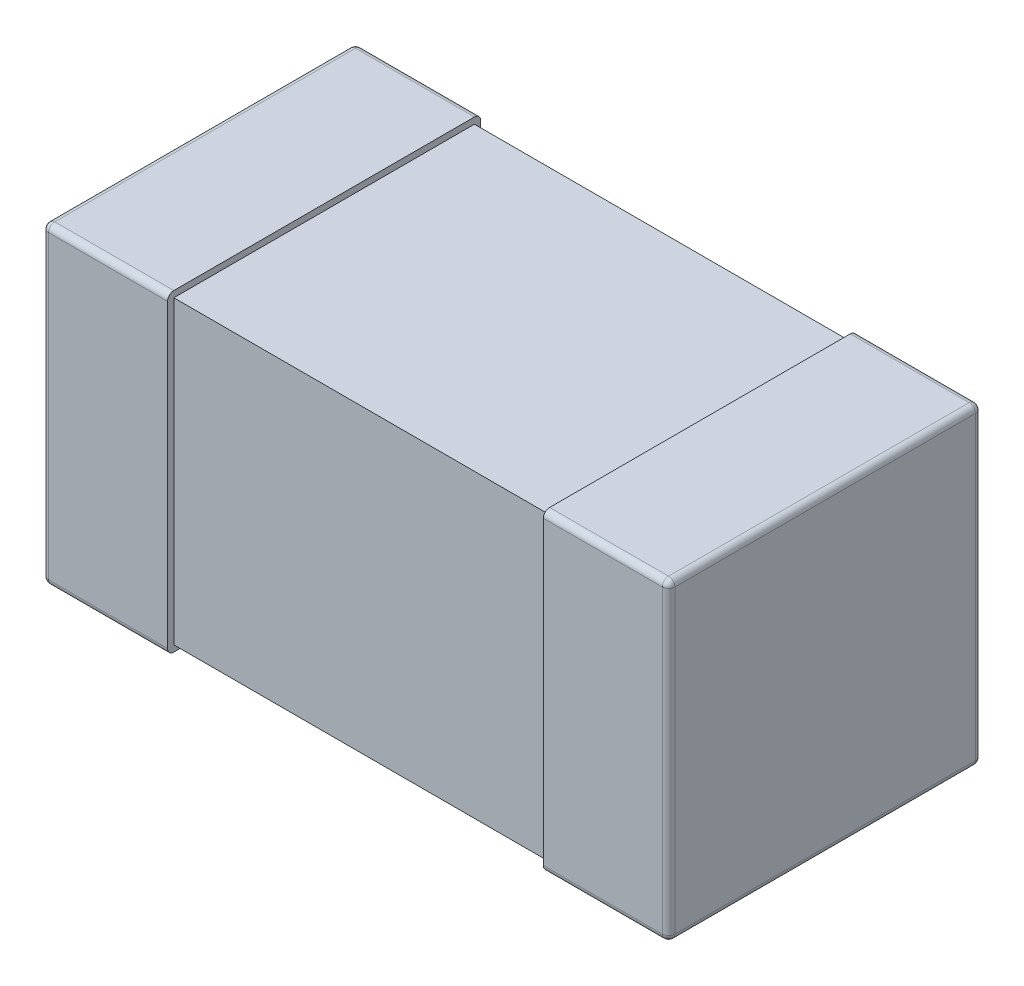
ISO-10303-21;
HEADER;
FILE_DESCRIPTION(('STEP AP214'),'2;1');
FILE_NAME('part.step','',(''),(''),'','','');
FILE_SCHEMA(('AUTOMOTIVE_DESIGN { 1 0 10303 214 1 1 1 1 }'));
ENDSEC;
DATA;
#1=APPLICATION_CONTEXT('core data for automotive mechanical design processes');
#2=APPLICATION_PROTOCOL_DEFINITION('international standard','automotive_design',2000,#1);
#3=PRODUCT_CONTEXT('',#1,'mechanical');
#4=PRODUCT('Part','Part','',(#3));
#5=PRODUCT_RELATED_PRODUCT_CATEGORY('part','',(#4));
#6=PRODUCT_DEFINITION_FORMATION('','',#4);
#7=PRODUCT_DEFINITION_CONTEXT('part definition',#1,'design');
#8=PRODUCT_DEFINITION('design','',#6,#7);
#9=PRODUCT_DEFINITION_SHAPE('','',#8);
#10=(LENGTH_UNIT() NAMED_UNIT(*) SI_UNIT(.MILLI.,.METRE.));
#11=(NAMED_UNIT(*) PLANE_ANGLE_UNIT() SI_UNIT($,.RADIAN.));
#12=(NAMED_UNIT(*) SI_UNIT($,.STERADIAN.) SOLID_ANGLE_UNIT());
#13=UNCERTAINTY_MEASURE_WITH_UNIT(LENGTH_MEASURE(1.E-05),#10,'distance_accuracy_value','');
#14=(GEOMETRIC_REPRESENTATION_CONTEXT(3) GLOBAL_UNCERTAINTY_ASSIGNED_CONTEXT((#13)) GLOBAL_UNIT_ASSIGNED_CONTEXT((#10,
#11,#12)) REPRESENTATION_CONTEXT('',''));
#15=CARTESIAN_POINT('',(0.,0.,0.));
#16=DIRECTION('',(0.,0.,1.));
#17=DIRECTION('',(1.,0.,0.));
#18=AXIS2_PLACEMENT_3D('',#15,#16,#17);
#19=CARTESIAN_POINT('',(-0.5,0.25,-0.25));
#20=DIRECTION('',(1.,0.,0.));
#21=DIRECTION('',(0.,0.,-1.));
#22=AXIS2_PLACEMENT_3D('',#19,#20,#21);
#23=PLANE('',#22);
#24=DIRECTION('',(0.,-1.,0.));
#25=VECTOR('',#24,1.);
#26=CARTESIAN_POINT('',(-0.5,0.25,-0.24));
#27=LINE('',#26,#25);
#28=CARTESIAN_POINT('',(-0.5,0.24,-0.24));
#29=VERTEX_POINT('',#28);
#30=CARTESIAN_POINT('',(-0.5,-0.24,-0.24));
#31=VERTEX_POINT('',#30);
#32=EDGE_CURVE('E351',#29,#31,#27,.T.);
#33=ORIENTED_EDGE('',*,*,#32,.T.);
#34=DIRECTION('',(0.,0.,1.));
#35=VECTOR('',#34,1.);
#36=CARTESIAN_POINT('',(-0.5,-0.24,-0.25));
#37=LINE('',#36,#35);
#38=CARTESIAN_POINT('',(-0.5,-0.24,0.24));
#39=VERTEX_POINT('',#38);
#40=EDGE_CURVE('E353',#31,#39,#37,.T.);
#41=ORIENTED_EDGE('',*,*,#40,.T.);
#42=DIRECTION('',(0.,-1.,0.));
#43=VECTOR('',#42,1.);
#44=CARTESIAN_POINT('',(-0.5,0.25,0.24));
#45=LINE('',#44,#43);
#46=CARTESIAN_POINT('',(-0.5,0.24,0.24));
#47=VERTEX_POINT('',#46);
#48=EDGE_CURVE('E349',#39,#47,#45,.F.);
#49=ORIENTED_EDGE('',*,*,#48,.T.);
#50=DIRECTION('',(0.,0.,1.));
#51=VECTOR('',#50,1.);
#52=CARTESIAN_POINT('',(-0.5,0.24,-0.25));
#53=LINE('',#52,#51);
#54=EDGE_CURVE('E347',#47,#29,#53,.F.);
#55=ORIENTED_EDGE('',*,*,#54,.T.);
#56=EDGE_LOOP('',(#33,#41,#49,#55));
#57=FACE_BOUND('',#56,.T.);
#58=ADVANCED_FACE('F36',(#57),#23,.F.);
#59=CARTESIAN_POINT('',(-0.5,0.25,0.25));
#60=DIRECTION('',(0.,0.,-1.));
#61=DIRECTION('',(-1.,0.,0.));
#62=AXIS2_PLACEMENT_3D('',#59,#60,#61);
#63=PLANE('',#62);
#64=DIRECTION('',(0.,-1.,0.));
#65=VECTOR('',#64,1.);
#66=CARTESIAN_POINT('',(-0.49,0.25,0.25));
#67=LINE('',#66,#65);
#68=CARTESIAN_POINT('',(-0.49,0.24,0.25));
#69=VERTEX_POINT('',#68);
#70=CARTESIAN_POINT('',(-0.49,-0.24,0.25));
#71=VERTEX_POINT('',#70);
#72=EDGE_CURVE('E379',#69,#71,#67,.T.);
#73=ORIENTED_EDGE('',*,*,#72,.T.);
#74=DIRECTION('',(1.,0.,0.));
#75=VECTOR('',#74,1.);
#76=CARTESIAN_POINT('',(-0.5,-0.24,0.25));
#77=LINE('',#76,#75);
#78=CARTESIAN_POINT('',(-0.3,-0.24,0.25));
#79=VERTEX_POINT('',#78);
#80=EDGE_CURVE('E381',#71,#79,#77,.T.);
#81=ORIENTED_EDGE('',*,*,#80,.T.);
#82=DIRECTION('',(0.,-1.,0.));
#83=VECTOR('',#82,1.);
#84=CARTESIAN_POINT('',(-0.3,0.25,0.25));
#85=LINE('',#84,#83);
#86=CARTESIAN_POINT('',(-0.3,0.24,0.25));
#87=VERTEX_POINT('',#86);
#88=EDGE_CURVE('E344',#87,#79,#85,.T.);
#89=ORIENTED_EDGE('',*,*,#88,.F.);
#90=DIRECTION('',(1.,0.,0.));
#91=VECTOR('',#90,1.);
#92=CARTESIAN_POINT('',(-0.5,0.24,0.25));
#93=LINE('',#92,#91);
#94=EDGE_CURVE('E377',#87,#69,#93,.F.);
#95=ORIENTED_EDGE('',*,*,#94,.T.);
#96=EDGE_LOOP('',(#73,#81,#89,#95));
#97=FACE_BOUND('',#96,.T.);
#98=ADVANCED_FACE('F450',(#97),#63,.F.);
#99=CARTESIAN_POINT('',(-0.3,0.25,-0.25));
#100=DIRECTION('',(-1.,0.,0.));
#101=DIRECTION('',(0.,0.,1.));
#102=AXIS2_PLACEMENT_3D('',#99,#100,#101);
#103=PLANE('',#102);
#104=DIRECTION('',(0.,1.,0.));
#105=VECTOR('',#104,1.);
#106=CARTESIAN_POINT('',(-0.3,0.24,-0.24));
#107=LINE('',#106,#105);
#108=CARTESIAN_POINT('',(-0.3,-0.24,-0.24));
#109=VERTEX_POINT('',#108);
#110=CARTESIAN_POINT('',(-0.3,0.24,-0.24));
#111=VERTEX_POINT('',#110);
#112=EDGE_CURVE('E210',#109,#111,#107,.T.);
#113=ORIENTED_EDGE('',*,*,#112,.F.);
#114=DIRECTION('',(0.,0.,-1.));
#115=VECTOR('',#114,1.);
#116=CARTESIAN_POINT('',(-0.3,-0.24,0.24));
#117=LINE('',#116,#115);
#118=CARTESIAN_POINT('',(-0.3,-0.24,0.24));
#119=VERTEX_POINT('',#118);
#120=EDGE_CURVE('E205',#119,#109,#117,.T.);
#121=ORIENTED_EDGE('',*,*,#120,.F.);
#122=DIRECTION('',(0.,-1.,0.));
#123=VECTOR('',#122,1.);
#124=CARTESIAN_POINT('',(-0.3,0.24,0.24));
#125=LINE('',#124,#123);
#126=CARTESIAN_POINT('',(-0.3,0.24,0.24));
#127=VERTEX_POINT('',#126);
#128=EDGE_CURVE('E326',#127,#119,#125,.T.);
#129=ORIENTED_EDGE('',*,*,#128,.F.);
#130=DIRECTION('',(0.,0.,1.));
#131=VECTOR('',#130,1.);
#132=CARTESIAN_POINT('',(-0.3,0.24,0.24));
#133=LINE('',#132,#131);
#134=EDGE_CURVE('E53',#111,#127,#133,.T.);
#135=ORIENTED_EDGE('',*,*,#134,.F.);
#136=EDGE_LOOP('',(#113,#121,#129,#135));
#137=FACE_BOUND('',#136,.T.);
#138=DIRECTION('',(0.,0.,-1.));
#139=VECTOR('',#138,1.);
#140=CARTESIAN_POINT('',(-0.3,-0.25,-0.25));
#141=LINE('',#140,#139);
#142=CARTESIAN_POINT('',(-0.3,-0.25,0.24));
#143=VERTEX_POINT('',#142);
#144=CARTESIAN_POINT('',(-0.3,-0.25,-0.24));
#145=VERTEX_POINT('',#144);
#146=EDGE_CURVE('E339',#143,#145,#141,.T.);
#147=ORIENTED_EDGE('',*,*,#146,.T.);
#148=CARTESIAN_POINT('',(-0.3,-0.24,-0.24));
#149=DIRECTION('',(-1.,0.,0.));
#150=DIRECTION('',(0.,0.,1.));
#151=AXIS2_PLACEMENT_3D('',#148,#149,#150);
#152=CIRCLE('',#151,0.01);
#153=CARTESIAN_POINT('',(-0.3,-0.24,-0.25));
#154=VERTEX_POINT('',#153);
#155=EDGE_CURVE('E375',#145,#154,#152,.F.);
#156=ORIENTED_EDGE('',*,*,#155,.T.);
#157=DIRECTION('',(0.,-1.,0.));
#158=VECTOR('',#157,1.);
#159=CARTESIAN_POINT('',(-0.3,0.25,-0.25));
#160=LINE('',#159,#158);
#161=CARTESIAN_POINT('',(-0.3,0.24,-0.25));
#162=VERTEX_POINT('',#161);
#163=EDGE_CURVE('E338',#162,#154,#160,.T.);
#164=ORIENTED_EDGE('',*,*,#163,.F.);
#165=CARTESIAN_POINT('',(-0.3,0.24,-0.24));
#166=DIRECTION('',(-1.,0.,0.));
#167=DIRECTION('',(0.,0.,1.));
#168=AXIS2_PLACEMENT_3D('',#165,#166,#167);
#169=CIRCLE('',#168,0.01);
#170=CARTESIAN_POINT('',(-0.3,0.25,-0.24));
#171=VERTEX_POINT('',#170);
#172=EDGE_CURVE('E371',#162,#171,#169,.F.);
#173=ORIENTED_EDGE('',*,*,#172,.T.);
#174=DIRECTION('',(0.,0.,-1.));
#175=VECTOR('',#174,1.);
#176=CARTESIAN_POINT('',(-0.3,0.25,-0.25));
#177=LINE('',#176,#175);
#178=CARTESIAN_POINT('',(-0.3,0.25,0.24));
#179=VERTEX_POINT('',#178);
#180=EDGE_CURVE('E336',#179,#171,#177,.T.);
#181=ORIENTED_EDGE('',*,*,#180,.F.);
#182=CARTESIAN_POINT('',(-0.3,0.24,0.24));
#183=DIRECTION('',(-1.,0.,0.));
#184=DIRECTION('',(0.,0.,1.));
#185=AXIS2_PLACEMENT_3D('',#182,#183,#184);
#186=CIRCLE('',#185,0.01);
#187=EDGE_CURVE('E369',#179,#87,#186,.F.);
#188=ORIENTED_EDGE('',*,*,#187,.T.);
#189=ORIENTED_EDGE('',*,*,#88,.T.);
#190=CARTESIAN_POINT('',(-0.3,-0.24,0.24));
#191=DIRECTION('',(-1.,0.,0.));
#192=DIRECTION('',(0.,0.,1.));
#193=AXIS2_PLACEMENT_3D('',#190,#191,#192);
#194=CIRCLE('',#193,0.01);
#195=EDGE_CURVE('E373',#79,#143,#194,.F.);
#196=ORIENTED_EDGE('',*,*,#195,.T.);
#197=EDGE_LOOP('',(#147,#156,#164,#173,#181,#188,#189,#196));
#198=FACE_BOUND('',#197,.T.);
#199=ADVANCED_FACE('F447',(#137,#198),#103,.F.);
#200=CARTESIAN_POINT('',(-0.5,0.25,-0.25));
#201=DIRECTION('',(0.,0.,1.));
#202=DIRECTION('',(1.,0.,0.));
#203=AXIS2_PLACEMENT_3D('',#200,#201,#202);
#204=PLANE('',#203);
#205=ORIENTED_EDGE('',*,*,#163,.T.);
#206=DIRECTION('',(-1.,0.,0.));
#207=VECTOR('',#206,1.);
#208=CARTESIAN_POINT('',(-0.5,-0.24,-0.25));
#209=LINE('',#208,#207);
#210=CARTESIAN_POINT('',(-0.49,-0.24,-0.25));
#211=VERTEX_POINT('',#210);
#212=EDGE_CURVE('E367',#154,#211,#209,.T.);
#213=ORIENTED_EDGE('',*,*,#212,.T.);
#214=DIRECTION('',(0.,-1.,0.));
#215=VECTOR('',#214,1.);
#216=CARTESIAN_POINT('',(-0.49,0.25,-0.25));
#217=LINE('',#216,#215);
#218=CARTESIAN_POINT('',(-0.49,0.24,-0.25));
#219=VERTEX_POINT('',#218);
#220=EDGE_CURVE('E365',#211,#219,#217,.F.);
#221=ORIENTED_EDGE('',*,*,#220,.T.);
#222=DIRECTION('',(-1.,0.,0.));
#223=VECTOR('',#222,1.);
#224=CARTESIAN_POINT('',(-0.3,0.24,-0.25));
#225=LINE('',#224,#223);
#226=EDGE_CURVE('E363',#219,#162,#225,.F.);
#227=ORIENTED_EDGE('',*,*,#226,.T.);
#228=EDGE_LOOP('',(#205,#213,#221,#227));
#229=FACE_BOUND('',#228,.T.);
#230=ADVANCED_FACE('F476',(#229),#204,.F.);
#231=CARTESIAN_POINT('',(-0.5,0.25,0.25));
#232=DIRECTION('',(0.,1.,0.));
#233=DIRECTION('',(0.,0.,1.));
#234=AXIS2_PLACEMENT_3D('',#231,#232,#233);
#235=PLANE('',#234);
#236=ORIENTED_EDGE('',*,*,#180,.T.);
#237=DIRECTION('',(-1.,0.,0.));
#238=VECTOR('',#237,1.);
#239=CARTESIAN_POINT('',(-0.5,0.25,-0.24));
#240=LINE('',#239,#238);
#241=CARTESIAN_POINT('',(-0.49,0.25,-0.24));
#242=VERTEX_POINT('',#241);
#243=EDGE_CURVE('E11',#171,#242,#240,.T.);
#244=ORIENTED_EDGE('',*,*,#243,.T.);
#245=DIRECTION('',(0.,0.,1.));
#246=VECTOR('',#245,1.);
#247=CARTESIAN_POINT('',(-0.49,0.25,0.25));
#248=LINE('',#247,#246);
#249=CARTESIAN_POINT('',(-0.49,0.25,0.24));
#250=VERTEX_POINT('',#249);
#251=EDGE_CURVE('E45',#242,#250,#248,.T.);
#252=ORIENTED_EDGE('',*,*,#251,.T.);
#253=DIRECTION('',(1.,0.,0.));
#254=VECTOR('',#253,1.);
#255=CARTESIAN_POINT('',(-0.3,0.25,0.24));
#256=LINE('',#255,#254);
#257=EDGE_CURVE('E383',#250,#179,#256,.T.);
#258=ORIENTED_EDGE('',*,*,#257,.T.);
#259=EDGE_LOOP('',(#236,#244,#252,#258));
#260=FACE_BOUND('',#259,.T.);
#261=ADVANCED_FACE('F437',(#260),#235,.T.);
#262=CARTESIAN_POINT('',(-0.5,-0.25,0.25));
#263=DIRECTION('',(0.,1.,0.));
#264=DIRECTION('',(0.,0.,1.));
#265=AXIS2_PLACEMENT_3D('',#262,#263,#264);
#266=PLANE('',#265);
#267=DIRECTION('',(0.,0.,1.));
#268=VECTOR('',#267,1.);
#269=CARTESIAN_POINT('',(-0.49,-0.25,0.25));
#270=LINE('',#269,#268);
#271=CARTESIAN_POINT('',(-0.49,-0.25,0.24));
#272=VERTEX_POINT('',#271);
#273=CARTESIAN_POINT('',(-0.49,-0.25,-0.24));
#274=VERTEX_POINT('',#273);
#275=EDGE_CURVE('E358',#272,#274,#270,.F.);
#276=ORIENTED_EDGE('',*,*,#275,.T.);
#277=DIRECTION('',(-1.,0.,0.));
#278=VECTOR('',#277,1.);
#279=CARTESIAN_POINT('',(-0.5,-0.25,-0.24));
#280=LINE('',#279,#278);
#281=EDGE_CURVE('E361',#274,#145,#280,.F.);
#282=ORIENTED_EDGE('',*,*,#281,.T.);
#283=ORIENTED_EDGE('',*,*,#146,.F.);
#284=DIRECTION('',(1.,0.,0.));
#285=VECTOR('',#284,1.);
#286=CARTESIAN_POINT('',(-0.5,-0.25,0.24));
#287=LINE('',#286,#285);
#288=EDGE_CURVE('E356',#143,#272,#287,.F.);
#289=ORIENTED_EDGE('',*,*,#288,.T.);
#290=EDGE_LOOP('',(#276,#282,#283,#289));
#291=FACE_BOUND('',#290,.T.);
#292=ADVANCED_FACE('F467',(#291),#266,.F.);
#293=CARTESIAN_POINT('',(-0.5,0.24,-0.24));
#294=DIRECTION('',(1.,0.,0.));
#295=DIRECTION('',(0.,0.,-1.));
#296=AXIS2_PLACEMENT_3D('',#293,#294,#295);
#297=CYLINDRICAL_SURFACE('',#296,0.01);
#298=ORIENTED_EDGE('',*,*,#172,.F.);
#299=ORIENTED_EDGE('',*,*,#226,.F.);
#300=CARTESIAN_POINT('',(-0.49,0.24,-0.24));
#301=DIRECTION('',(-1.,0.,0.));
#302=DIRECTION('',(0.,0.,1.));
#303=AXIS2_PLACEMENT_3D('',#300,#301,#302);
#304=CIRCLE('',#303,0.01);
#305=EDGE_CURVE('E40',#242,#219,#304,.T.);
#306=ORIENTED_EDGE('',*,*,#305,.F.);
#307=ORIENTED_EDGE('',*,*,#243,.F.);
#308=EDGE_LOOP('',(#298,#299,#306,#307));
#309=FACE_BOUND('',#308,.T.);
#310=ADVANCED_FACE('F38',(#309),#297,.T.);
#311=CARTESIAN_POINT('',(-0.49,0.24,0.25));
#312=DIRECTION('',(0.,0.,-1.));
#313=DIRECTION('',(-1.,0.,0.));
#314=AXIS2_PLACEMENT_3D('',#311,#312,#313);
#315=CYLINDRICAL_SURFACE('',#314,0.01);
#316=CARTESIAN_POINT('',(-0.49,0.24,0.24));
#317=DIRECTION('',(0.,0.,1.));
#318=DIRECTION('',(1.,0.,0.));
#319=AXIS2_PLACEMENT_3D('',#316,#317,#318);
#320=CIRCLE('',#319,0.01);
#321=EDGE_CURVE('E410',#250,#47,#320,.T.);
#322=ORIENTED_EDGE('',*,*,#321,.F.);
#323=ORIENTED_EDGE('',*,*,#251,.F.);
#324=CARTESIAN_POINT('',(-0.49,0.24,-0.24));
#325=DIRECTION('',(0.,0.,-1.));
#326=DIRECTION('',(0.,1.,0.));
#327=AXIS2_PLACEMENT_3D('',#324,#325,#326);
#328=CIRCLE('',#327,0.01);
#329=EDGE_CURVE('E412',#29,#242,#328,.T.);
#330=ORIENTED_EDGE('',*,*,#329,.F.);
#331=ORIENTED_EDGE('',*,*,#54,.F.);
#332=EDGE_LOOP('',(#322,#323,#330,#331));
#333=FACE_BOUND('',#332,.T.);
#334=ADVANCED_FACE('F435',(#333),#315,.T.);
#335=CARTESIAN_POINT('',(-0.5,0.24,0.24));
#336=DIRECTION('',(-1.,0.,0.));
#337=DIRECTION('',(0.,0.,1.));
#338=AXIS2_PLACEMENT_3D('',#335,#336,#337);
#339=CYLINDRICAL_SURFACE('',#338,0.01);
#340=ORIENTED_EDGE('',*,*,#187,.F.);
#341=ORIENTED_EDGE('',*,*,#257,.F.);
#342=CARTESIAN_POINT('',(-0.49,0.24,0.24));
#343=DIRECTION('',(-1.,0.,0.));
#344=DIRECTION('',(0.,0.,1.));
#345=AXIS2_PLACEMENT_3D('',#342,#343,#344);
#346=CIRCLE('',#345,0.01);
#347=EDGE_CURVE('E407',#69,#250,#346,.T.);
#348=ORIENTED_EDGE('',*,*,#347,.F.);
#349=ORIENTED_EDGE('',*,*,#94,.F.);
#350=EDGE_LOOP('',(#340,#341,#348,#349));
#351=FACE_BOUND('',#350,.T.);
#352=ADVANCED_FACE('F442',(#351),#339,.T.);
#353=CARTESIAN_POINT('',(-0.49,0.24,-0.24));
#354=DIRECTION('',(0.,0.,1.));
#355=DIRECTION('',(1.,0.,0.));
#356=AXIS2_PLACEMENT_3D('',#353,#354,#355);
#357=SPHERICAL_SURFACE('',#356,0.01);
#358=ORIENTED_EDGE('',*,*,#329,.T.);
#359=ORIENTED_EDGE('',*,*,#305,.T.);
#360=CARTESIAN_POINT('',(-0.49,0.24,-0.24));
#361=DIRECTION('',(0.,1.,0.));
#362=DIRECTION('',(0.,0.,1.));
#363=AXIS2_PLACEMENT_3D('',#360,#361,#362);
#364=CIRCLE('',#363,0.01);
#365=EDGE_CURVE('E404',#29,#219,#364,.F.);
#366=ORIENTED_EDGE('',*,*,#365,.F.);
#367=EDGE_LOOP('',(#358,#359,#366));
#368=FACE_BOUND('',#367,.T.);
#369=ADVANCED_FACE('F419',(#368),#357,.T.);
#370=CARTESIAN_POINT('',(-0.49,0.24,0.24));
#371=DIRECTION('',(0.,0.,1.));
#372=DIRECTION('',(1.,0.,0.));
#373=AXIS2_PLACEMENT_3D('',#370,#371,#372);
#374=SPHERICAL_SURFACE('',#373,0.01);
#375=ORIENTED_EDGE('',*,*,#347,.T.);
#376=ORIENTED_EDGE('',*,*,#321,.T.);
#377=CARTESIAN_POINT('',(-0.49,0.24,0.24));
#378=DIRECTION('',(0.,1.,0.));
#379=DIRECTION('',(0.,0.,1.));
#380=AXIS2_PLACEMENT_3D('',#377,#378,#379);
#381=CIRCLE('',#380,0.01);
#382=EDGE_CURVE('E401',#69,#47,#381,.F.);
#383=ORIENTED_EDGE('',*,*,#382,.F.);
#384=EDGE_LOOP('',(#375,#376,#383));
#385=FACE_BOUND('',#384,.T.);
#386=ADVANCED_FACE('F508',(#385),#374,.T.);
#387=CARTESIAN_POINT('',(-0.5,-0.24,-0.24));
#388=DIRECTION('',(-1.,0.,0.));
#389=DIRECTION('',(0.,0.,1.));
#390=AXIS2_PLACEMENT_3D('',#387,#388,#389);
#391=CYLINDRICAL_SURFACE('',#390,0.01);
#392=ORIENTED_EDGE('',*,*,#155,.F.);
#393=ORIENTED_EDGE('',*,*,#281,.F.);
#394=CARTESIAN_POINT('',(-0.49,-0.24,-0.24));
#395=DIRECTION('',(-1.,0.,0.));
#396=DIRECTION('',(0.,0.,1.));
#397=AXIS2_PLACEMENT_3D('',#394,#395,#396);
#398=CIRCLE('',#397,0.01);
#399=EDGE_CURVE('E398',#211,#274,#398,.T.);
#400=ORIENTED_EDGE('',*,*,#399,.F.);
#401=ORIENTED_EDGE('',*,*,#212,.F.);
#402=EDGE_LOOP('',(#392,#393,#400,#401));
#403=FACE_BOUND('',#402,.T.);
#404=ADVANCED_FACE('F474',(#403),#391,.T.);
#405=CARTESIAN_POINT('',(-0.49,0.25,-0.24));
#406=DIRECTION('',(0.,-1.,0.));
#407=DIRECTION('',(0.,0.,-1.));
#408=AXIS2_PLACEMENT_3D('',#405,#406,#407);
#409=CYLINDRICAL_SURFACE('',#408,0.01);
#410=ORIENTED_EDGE('',*,*,#365,.T.);
#411=ORIENTED_EDGE('',*,*,#220,.F.);
#412=CARTESIAN_POINT('',(-0.49,-0.24,-0.24));
#413=DIRECTION('',(0.,-1.,0.));
#414=DIRECTION('',(0.,0.,-1.));
#415=AXIS2_PLACEMENT_3D('',#412,#413,#414);
#416=CIRCLE('',#415,0.01);
#417=EDGE_CURVE('E395',#31,#211,#416,.T.);
#418=ORIENTED_EDGE('',*,*,#417,.F.);
#419=ORIENTED_EDGE('',*,*,#32,.F.);
#420=EDGE_LOOP('',(#410,#411,#418,#419));
#421=FACE_BOUND('',#420,.T.);
#422=ADVANCED_FACE('F425',(#421),#409,.T.);
#423=CARTESIAN_POINT('',(-0.49,0.25,0.24));
#424=DIRECTION('',(0.,-1.,0.));
#425=DIRECTION('',(0.,0.,-1.));
#426=AXIS2_PLACEMENT_3D('',#423,#424,#425);
#427=CYLINDRICAL_SURFACE('',#426,0.01);
#428=ORIENTED_EDGE('',*,*,#382,.T.);
#429=ORIENTED_EDGE('',*,*,#48,.F.);
#430=CARTESIAN_POINT('',(-0.49,-0.24,0.24));
#431=DIRECTION('',(0.,-1.,0.));
#432=DIRECTION('',(0.,0.,-1.));
#433=AXIS2_PLACEMENT_3D('',#430,#431,#432);
#434=CIRCLE('',#433,0.01);
#435=EDGE_CURVE('E392',#71,#39,#434,.T.);
#436=ORIENTED_EDGE('',*,*,#435,.F.);
#437=ORIENTED_EDGE('',*,*,#72,.F.);
#438=EDGE_LOOP('',(#428,#429,#436,#437));
#439=FACE_BOUND('',#438,.T.);
#440=ADVANCED_FACE('F460',(#439),#427,.T.);
#441=CARTESIAN_POINT('',(-0.5,-0.24,0.24));
#442=DIRECTION('',(1.,0.,0.));
#443=DIRECTION('',(0.,0.,-1.));
#444=AXIS2_PLACEMENT_3D('',#441,#442,#443);
#445=CYLINDRICAL_SURFACE('',#444,0.01);
#446=ORIENTED_EDGE('',*,*,#195,.F.);
#447=ORIENTED_EDGE('',*,*,#80,.F.);
#448=CARTESIAN_POINT('',(-0.49,-0.24,0.24));
#449=DIRECTION('',(-1.,0.,0.));
#450=DIRECTION('',(0.,0.,1.));
#451=AXIS2_PLACEMENT_3D('',#448,#449,#450);
#452=CIRCLE('',#451,0.01);
#453=EDGE_CURVE('E389',#272,#71,#452,.T.);
#454=ORIENTED_EDGE('',*,*,#453,.F.);
#455=ORIENTED_EDGE('',*,*,#288,.F.);
#456=EDGE_LOOP('',(#446,#447,#454,#455));
#457=FACE_BOUND('',#456,.T.);
#458=ADVANCED_FACE('F456',(#457),#445,.T.);
#459=CARTESIAN_POINT('',(-0.49,-0.24,-0.24));
#460=DIRECTION('',(0.,0.,1.));
#461=DIRECTION('',(1.,0.,0.));
#462=AXIS2_PLACEMENT_3D('',#459,#460,#461);
#463=SPHERICAL_SURFACE('',#462,0.01);
#464=ORIENTED_EDGE('',*,*,#417,.T.);
#465=ORIENTED_EDGE('',*,*,#399,.T.);
#466=CARTESIAN_POINT('',(-0.49,-0.24,-0.24));
#467=DIRECTION('',(0.,0.,-1.));
#468=DIRECTION('',(-1.,0.,0.));
#469=AXIS2_PLACEMENT_3D('',#466,#467,#468);
#470=CIRCLE('',#469,0.01);
#471=EDGE_CURVE('E387',#31,#274,#470,.F.);
#472=ORIENTED_EDGE('',*,*,#471,.F.);
#473=EDGE_LOOP('',(#464,#465,#472));
#474=FACE_BOUND('',#473,.T.);
#475=ADVANCED_FACE('F496',(#474),#463,.T.);
#476=CARTESIAN_POINT('',(-0.49,-0.24,0.24));
#477=DIRECTION('',(0.,0.,1.));
#478=DIRECTION('',(1.,0.,0.));
#479=AXIS2_PLACEMENT_3D('',#476,#477,#478);
#480=SPHERICAL_SURFACE('',#479,0.01);
#481=ORIENTED_EDGE('',*,*,#453,.T.);
#482=ORIENTED_EDGE('',*,*,#435,.T.);
#483=CARTESIAN_POINT('',(-0.49,-0.24,0.24));
#484=DIRECTION('',(0.,0.,1.));
#485=DIRECTION('',(1.,0.,0.));
#486=AXIS2_PLACEMENT_3D('',#483,#484,#485);
#487=CIRCLE('',#486,0.01);
#488=EDGE_CURVE('E335',#272,#39,#487,.F.);
#489=ORIENTED_EDGE('',*,*,#488,.F.);
#490=EDGE_LOOP('',(#481,#482,#489));
#491=FACE_BOUND('',#490,.T.);
#492=ADVANCED_FACE('F463',(#491),#480,.T.);
#493=CARTESIAN_POINT('',(-0.49,-0.24,-0.25));
#494=DIRECTION('',(0.,0.,1.));
#495=DIRECTION('',(1.,0.,0.));
#496=AXIS2_PLACEMENT_3D('',#493,#494,#495);
#497=CYLINDRICAL_SURFACE('',#496,0.01);
#498=ORIENTED_EDGE('',*,*,#471,.T.);
#499=ORIENTED_EDGE('',*,*,#275,.F.);
#500=ORIENTED_EDGE('',*,*,#488,.T.);
#501=ORIENTED_EDGE('',*,*,#40,.F.);
#502=EDGE_LOOP('',(#498,#499,#500,#501));
#503=FACE_BOUND('',#502,.T.);
#504=ADVANCED_FACE('F465',(#503),#497,.T.);
#505=CARTESIAN_POINT('',(-0.978822509939086,-0.24,0.24));
#506=DIRECTION('',(0.,-1.,0.));
#507=DIRECTION('',(0.,0.,-1.));
#508=AXIS2_PLACEMENT_3D('',#505,#506,#507);
#509=PLANE('',#508);
#510=DIRECTION('',(1.,0.,0.));
#511=VECTOR('',#510,1.);
#512=CARTESIAN_POINT('',(-0.978822509939086,-0.24,0.24));
#513=LINE('',#512,#511);
#514=CARTESIAN_POINT('',(0.3,-0.24,0.24));
#515=VERTEX_POINT('',#514);
#516=EDGE_CURVE('E328',#119,#515,#513,.T.);
#517=ORIENTED_EDGE('',*,*,#516,.F.);
#518=ORIENTED_EDGE('',*,*,#120,.T.);
#519=DIRECTION('',(1.,0.,0.));
#520=VECTOR('',#519,1.);
#521=CARTESIAN_POINT('',(-0.978822509939086,-0.24,-0.24));
#522=LINE('',#521,#520);
#523=CARTESIAN_POINT('',(0.3,-0.24,-0.24));
#524=VERTEX_POINT('',#523);
#525=EDGE_CURVE('E198',#109,#524,#522,.T.);
#526=ORIENTED_EDGE('',*,*,#525,.T.);
#527=DIRECTION('',(0.,0.,-1.));
#528=VECTOR('',#527,1.);
#529=CARTESIAN_POINT('',(0.3,-0.24,0.24));
#530=LINE('',#529,#528);
#531=EDGE_CURVE('E202',#515,#524,#530,.T.);
#532=ORIENTED_EDGE('',*,*,#531,.F.);
#533=EDGE_LOOP('',(#517,#518,#526,#532));
#534=FACE_BOUND('',#533,.T.);
#535=ADVANCED_FACE('F201',(#534),#509,.T.);
#536=CARTESIAN_POINT('',(-0.978822509939086,0.24,-0.24));
#537=DIRECTION('',(0.,0.,-1.));
#538=DIRECTION('',(-1.,0.,0.));
#539=AXIS2_PLACEMENT_3D('',#536,#537,#538);
#540=PLANE('',#539);
#541=ORIENTED_EDGE('',*,*,#525,.F.);
#542=ORIENTED_EDGE('',*,*,#112,.T.);
#543=DIRECTION('',(1.,0.,0.));
#544=VECTOR('',#543,1.);
#545=CARTESIAN_POINT('',(-0.978822509939086,0.24,-0.24));
#546=LINE('',#545,#544);
#547=CARTESIAN_POINT('',(0.3,0.24,-0.24));
#548=VERTEX_POINT('',#547);
#549=EDGE_CURVE('E222',#111,#548,#546,.T.);
#550=ORIENTED_EDGE('',*,*,#549,.T.);
#551=DIRECTION('',(0.,1.,0.));
#552=VECTOR('',#551,1.);
#553=CARTESIAN_POINT('',(0.3,0.24,-0.24));
#554=LINE('',#553,#552);
#555=EDGE_CURVE('E217',#524,#548,#554,.T.);
#556=ORIENTED_EDGE('',*,*,#555,.F.);
#557=EDGE_LOOP('',(#541,#542,#550,#556));
#558=FACE_BOUND('',#557,.T.);
#559=ADVANCED_FACE('F221',(#558),#540,.T.);
#560=CARTESIAN_POINT('',(-0.978822509939086,0.24,0.24));
#561=DIRECTION('',(0.,1.,0.));
#562=DIRECTION('',(0.,0.,1.));
#563=AXIS2_PLACEMENT_3D('',#560,#561,#562);
#564=PLANE('',#563);
#565=ORIENTED_EDGE('',*,*,#549,.F.);
#566=ORIENTED_EDGE('',*,*,#134,.T.);
#567=DIRECTION('',(1.,0.,0.));
#568=VECTOR('',#567,1.);
#569=CARTESIAN_POINT('',(-0.978822509939086,0.24,0.24));
#570=LINE('',#569,#568);
#571=CARTESIAN_POINT('',(0.3,0.24,0.24));
#572=VERTEX_POINT('',#571);
#573=EDGE_CURVE('E329',#127,#572,#570,.T.);
#574=ORIENTED_EDGE('',*,*,#573,.T.);
#575=DIRECTION('',(0.,0.,1.));
#576=VECTOR('',#575,1.);
#577=CARTESIAN_POINT('',(0.3,0.24,0.24));
#578=LINE('',#577,#576);
#579=EDGE_CURVE('E224',#548,#572,#578,.T.);
#580=ORIENTED_EDGE('',*,*,#579,.F.);
#581=EDGE_LOOP('',(#565,#566,#574,#580));
#582=FACE_BOUND('',#581,.T.);
#583=ADVANCED_FACE('F568',(#582),#564,.T.);
#584=CARTESIAN_POINT('',(-0.978822509939086,0.24,0.24));
#585=DIRECTION('',(0.,0.,1.));
#586=DIRECTION('',(1.,0.,0.));
#587=AXIS2_PLACEMENT_3D('',#584,#585,#586);
#588=PLANE('',#587);
#589=ORIENTED_EDGE('',*,*,#573,.F.);
#590=ORIENTED_EDGE('',*,*,#128,.T.);
#591=ORIENTED_EDGE('',*,*,#516,.T.);
#592=DIRECTION('',(0.,-1.,0.));
#593=VECTOR('',#592,1.);
#594=CARTESIAN_POINT('',(0.3,0.24,0.24));
#595=LINE('',#594,#593);
#596=EDGE_CURVE('E219',#572,#515,#595,.T.);
#597=ORIENTED_EDGE('',*,*,#596,.F.);
#598=EDGE_LOOP('',(#589,#590,#591,#597));
#599=FACE_BOUND('',#598,.T.);
#600=ADVANCED_FACE('F575',(#599),#588,.T.);
#601=CARTESIAN_POINT('',(0.5,0.25,-0.25));
#602=DIRECTION('',(-1.,0.,0.));
#603=DIRECTION('',(0.,0.,-1.));
#604=AXIS2_PLACEMENT_3D('',#601,#602,#603);
#605=PLANE('',#604);
#606=DIRECTION('',(0.,-1.,0.));
#607=VECTOR('',#606,1.);
#608=CARTESIAN_POINT('',(0.5,0.25,-0.24));
#609=LINE('',#608,#607);
#610=CARTESIAN_POINT('',(0.5,0.24,-0.24));
#611=VERTEX_POINT('',#610);
#612=CARTESIAN_POINT('',(0.5,-0.24,-0.24));
#613=VERTEX_POINT('',#612);
#614=EDGE_CURVE('E248',#611,#613,#609,.T.);
#615=ORIENTED_EDGE('',*,*,#614,.F.);
#616=DIRECTION('',(0.,0.,1.));
#617=VECTOR('',#616,1.);
#618=CARTESIAN_POINT('',(0.5,0.24,-0.25));
#619=LINE('',#618,#617);
#620=CARTESIAN_POINT('',(0.5,0.24,0.24));
#621=VERTEX_POINT('',#620);
#622=EDGE_CURVE('E242',#621,#611,#619,.F.);
#623=ORIENTED_EDGE('',*,*,#622,.F.);
#624=DIRECTION('',(0.,-1.,0.));
#625=VECTOR('',#624,1.);
#626=CARTESIAN_POINT('',(0.5,0.25,0.24));
#627=LINE('',#626,#625);
#628=CARTESIAN_POINT('',(0.5,-0.24,0.24));
#629=VERTEX_POINT('',#628);
#630=EDGE_CURVE('E245',#629,#621,#627,.F.);
#631=ORIENTED_EDGE('',*,*,#630,.F.);
#632=DIRECTION('',(0.,0.,1.));
#633=VECTOR('',#632,1.);
#634=CARTESIAN_POINT('',(0.5,-0.24,-0.25));
#635=LINE('',#634,#633);
#636=EDGE_CURVE('E251',#613,#629,#635,.T.);
#637=ORIENTED_EDGE('',*,*,#636,.F.);
#638=EDGE_LOOP('',(#615,#623,#631,#637));
#639=FACE_BOUND('',#638,.T.);
#640=ADVANCED_FACE('F582',(#639),#605,.F.);
#641=CARTESIAN_POINT('',(0.5,0.25,0.25));
#642=DIRECTION('',(0.,0.,-1.));
#643=DIRECTION('',(1.,0.,0.));
#644=AXIS2_PLACEMENT_3D('',#641,#642,#643);
#645=PLANE('',#644);
#646=DIRECTION('',(0.,-1.,0.));
#647=VECTOR('',#646,1.);
#648=CARTESIAN_POINT('',(0.49,0.25,0.25));
#649=LINE('',#648,#647);
#650=CARTESIAN_POINT('',(0.49,0.24,0.25));
#651=VERTEX_POINT('',#650);
#652=CARTESIAN_POINT('',(0.49,-0.24,0.25));
#653=VERTEX_POINT('',#652);
#654=EDGE_CURVE('E284',#651,#653,#649,.T.);
#655=ORIENTED_EDGE('',*,*,#654,.F.);
#656=DIRECTION('',(-1.,0.,0.));
#657=VECTOR('',#656,1.);
#658=CARTESIAN_POINT('',(0.5,0.24,0.25));
#659=LINE('',#658,#657);
#660=CARTESIAN_POINT('',(0.3,0.24,0.25));
#661=VERTEX_POINT('',#660);
#662=EDGE_CURVE('E281',#661,#651,#659,.F.);
#663=ORIENTED_EDGE('',*,*,#662,.F.);
#664=DIRECTION('',(0.,-1.,0.));
#665=VECTOR('',#664,1.);
#666=CARTESIAN_POINT('',(0.3,0.25,0.25));
#667=LINE('',#666,#665);
#668=CARTESIAN_POINT('',(0.3,-0.24,0.25));
#669=VERTEX_POINT('',#668);
#670=EDGE_CURVE('E239',#661,#669,#667,.T.);
#671=ORIENTED_EDGE('',*,*,#670,.T.);
#672=DIRECTION('',(-1.,0.,0.));
#673=VECTOR('',#672,1.);
#674=CARTESIAN_POINT('',(0.5,-0.24,0.25));
#675=LINE('',#674,#673);
#676=EDGE_CURVE('E287',#653,#669,#675,.T.);
#677=ORIENTED_EDGE('',*,*,#676,.F.);
#678=EDGE_LOOP('',(#655,#663,#671,#677));
#679=FACE_BOUND('',#678,.T.);
#680=ADVANCED_FACE('F591',(#679),#645,.F.);
#681=CARTESIAN_POINT('',(0.3,0.25,-0.25));
#682=DIRECTION('',(1.,0.,0.));
#683=DIRECTION('',(0.,0.,1.));
#684=AXIS2_PLACEMENT_3D('',#681,#682,#683);
#685=PLANE('',#684);
#686=ORIENTED_EDGE('',*,*,#555,.T.);
#687=ORIENTED_EDGE('',*,*,#579,.T.);
#688=ORIENTED_EDGE('',*,*,#596,.T.);
#689=ORIENTED_EDGE('',*,*,#531,.T.);
#690=EDGE_LOOP('',(#686,#687,#688,#689));
#691=FACE_BOUND('',#690,.T.);
#692=DIRECTION('',(0.,0.,-1.));
#693=VECTOR('',#692,1.);
#694=CARTESIAN_POINT('',(0.3,-0.25,-0.25));
#695=LINE('',#694,#693);
#696=CARTESIAN_POINT('',(0.3,-0.25,0.24));
#697=VERTEX_POINT('',#696);
#698=CARTESIAN_POINT('',(0.3,-0.25,-0.24));
#699=VERTEX_POINT('',#698);
#700=EDGE_CURVE('E233',#697,#699,#695,.T.);
#701=ORIENTED_EDGE('',*,*,#700,.F.);
#702=CARTESIAN_POINT('',(0.3,-0.24,0.24));
#703=DIRECTION('',(-1.,0.,0.));
#704=DIRECTION('',(0.,0.,1.));
#705=AXIS2_PLACEMENT_3D('',#702,#703,#704);
#706=CIRCLE('',#705,0.01);
#707=EDGE_CURVE('E275',#669,#697,#706,.F.);
#708=ORIENTED_EDGE('',*,*,#707,.F.);
#709=ORIENTED_EDGE('',*,*,#670,.F.);
#710=CARTESIAN_POINT('',(0.3,0.24,0.24));
#711=DIRECTION('',(-1.,0.,0.));
#712=DIRECTION('',(0.,0.,1.));
#713=AXIS2_PLACEMENT_3D('',#710,#711,#712);
#714=CIRCLE('',#713,0.01);
#715=CARTESIAN_POINT('',(0.3,0.25,0.24));
#716=VERTEX_POINT('',#715);
#717=EDGE_CURVE('E270',#716,#661,#714,.F.);
#718=ORIENTED_EDGE('',*,*,#717,.F.);
#719=DIRECTION('',(0.,0.,-1.));
#720=VECTOR('',#719,1.);
#721=CARTESIAN_POINT('',(0.3,0.25,-0.25));
#722=LINE('',#721,#720);
#723=CARTESIAN_POINT('',(0.3,0.25,-0.24));
#724=VERTEX_POINT('',#723);
#725=EDGE_CURVE('E229',#716,#724,#722,.T.);
#726=ORIENTED_EDGE('',*,*,#725,.T.);
#727=CARTESIAN_POINT('',(0.3,0.24,-0.24));
#728=DIRECTION('',(-1.,0.,0.));
#729=DIRECTION('',(0.,0.,1.));
#730=AXIS2_PLACEMENT_3D('',#727,#728,#729);
#731=CIRCLE('',#730,0.01);
#732=CARTESIAN_POINT('',(0.3,0.24,-0.25));
#733=VERTEX_POINT('',#732);
#734=EDGE_CURVE('E272',#733,#724,#731,.F.);
#735=ORIENTED_EDGE('',*,*,#734,.F.);
#736=DIRECTION('',(0.,-1.,0.));
#737=VECTOR('',#736,1.);
#738=CARTESIAN_POINT('',(0.3,0.25,-0.25));
#739=LINE('',#738,#737);
#740=CARTESIAN_POINT('',(0.3,-0.24,-0.25));
#741=VERTEX_POINT('',#740);
#742=EDGE_CURVE('E232',#733,#741,#739,.T.);
#743=ORIENTED_EDGE('',*,*,#742,.T.);
#744=CARTESIAN_POINT('',(0.3,-0.24,-0.24));
#745=DIRECTION('',(-1.,0.,0.));
#746=DIRECTION('',(0.,0.,1.));
#747=AXIS2_PLACEMENT_3D('',#744,#745,#746);
#748=CIRCLE('',#747,0.01);
#749=EDGE_CURVE('E278',#699,#741,#748,.F.);
#750=ORIENTED_EDGE('',*,*,#749,.F.);
#751=EDGE_LOOP('',(#701,#708,#709,#718,#726,#735,#743,#750));
#752=FACE_BOUND('',#751,.T.);
#753=ADVANCED_FACE('F214',(#691,#752),#685,.F.);
#754=CARTESIAN_POINT('',(0.5,0.25,-0.25));
#755=DIRECTION('',(0.,0.,1.));
#756=DIRECTION('',(-1.,0.,0.));
#757=AXIS2_PLACEMENT_3D('',#754,#755,#756);
#758=PLANE('',#757);
#759=ORIENTED_EDGE('',*,*,#742,.F.);
#760=DIRECTION('',(1.,0.,0.));
#761=VECTOR('',#760,1.);
#762=CARTESIAN_POINT('',(0.3,0.24,-0.25));
#763=LINE('',#762,#761);
#764=CARTESIAN_POINT('',(0.49,0.24,-0.25));
#765=VERTEX_POINT('',#764);
#766=EDGE_CURVE('E262',#765,#733,#763,.F.);
#767=ORIENTED_EDGE('',*,*,#766,.F.);
#768=DIRECTION('',(0.,-1.,0.));
#769=VECTOR('',#768,1.);
#770=CARTESIAN_POINT('',(0.49,0.25,-0.25));
#771=LINE('',#770,#769);
#772=CARTESIAN_POINT('',(0.49,-0.24,-0.25));
#773=VERTEX_POINT('',#772);
#774=EDGE_CURVE('E264',#773,#765,#771,.F.);
#775=ORIENTED_EDGE('',*,*,#774,.F.);
#776=DIRECTION('',(1.,0.,0.));
#777=VECTOR('',#776,1.);
#778=CARTESIAN_POINT('',(0.5,-0.24,-0.25));
#779=LINE('',#778,#777);
#780=EDGE_CURVE('E267',#741,#773,#779,.T.);
#781=ORIENTED_EDGE('',*,*,#780,.F.);
#782=EDGE_LOOP('',(#759,#767,#775,#781));
#783=FACE_BOUND('',#782,.T.);
#784=ADVANCED_FACE('F606',(#783),#758,.F.);
#785=CARTESIAN_POINT('',(0.5,0.25,0.25));
#786=DIRECTION('',(0.,1.,0.));
#787=DIRECTION('',(0.,0.,1.));
#788=AXIS2_PLACEMENT_3D('',#785,#786,#787);
#789=PLANE('',#788);
#790=ORIENTED_EDGE('',*,*,#725,.F.);
#791=DIRECTION('',(-1.,0.,0.));
#792=VECTOR('',#791,1.);
#793=CARTESIAN_POINT('',(0.3,0.25,0.24));
#794=LINE('',#793,#792);
#795=CARTESIAN_POINT('',(0.49,0.25,0.24));
#796=VERTEX_POINT('',#795);
#797=EDGE_CURVE('E290',#796,#716,#794,.T.);
#798=ORIENTED_EDGE('',*,*,#797,.F.);
#799=DIRECTION('',(0.,0.,1.));
#800=VECTOR('',#799,1.);
#801=CARTESIAN_POINT('',(0.49,0.25,0.25));
#802=LINE('',#801,#800);
#803=CARTESIAN_POINT('',(0.49,0.25,-0.24));
#804=VERTEX_POINT('',#803);
#805=EDGE_CURVE('E292',#804,#796,#802,.T.);
#806=ORIENTED_EDGE('',*,*,#805,.F.);
#807=DIRECTION('',(1.,0.,0.));
#808=VECTOR('',#807,1.);
#809=CARTESIAN_POINT('',(0.5,0.25,-0.24));
#810=LINE('',#809,#808);
#811=EDGE_CURVE('E295',#724,#804,#810,.T.);
#812=ORIENTED_EDGE('',*,*,#811,.F.);
#813=EDGE_LOOP('',(#790,#798,#806,#812));
#814=FACE_BOUND('',#813,.T.);
#815=ADVANCED_FACE('F612',(#814),#789,.T.);
#816=CARTESIAN_POINT('',(0.5,-0.25,0.25));
#817=DIRECTION('',(0.,1.,0.));
#818=DIRECTION('',(0.,0.,1.));
#819=AXIS2_PLACEMENT_3D('',#816,#817,#818);
#820=PLANE('',#819);
#821=DIRECTION('',(0.,0.,1.));
#822=VECTOR('',#821,1.);
#823=CARTESIAN_POINT('',(0.49,-0.25,0.25));
#824=LINE('',#823,#822);
#825=CARTESIAN_POINT('',(0.49,-0.25,0.24));
#826=VERTEX_POINT('',#825);
#827=CARTESIAN_POINT('',(0.49,-0.25,-0.24));
#828=VERTEX_POINT('',#827);
#829=EDGE_CURVE('E257',#826,#828,#824,.F.);
#830=ORIENTED_EDGE('',*,*,#829,.F.);
#831=DIRECTION('',(-1.,0.,0.));
#832=VECTOR('',#831,1.);
#833=CARTESIAN_POINT('',(0.5,-0.25,0.24));
#834=LINE('',#833,#832);
#835=EDGE_CURVE('E254',#697,#826,#834,.F.);
#836=ORIENTED_EDGE('',*,*,#835,.F.);
#837=ORIENTED_EDGE('',*,*,#700,.T.);
#838=DIRECTION('',(1.,0.,0.));
#839=VECTOR('',#838,1.);
#840=CARTESIAN_POINT('',(0.5,-0.25,-0.24));
#841=LINE('',#840,#839);
#842=EDGE_CURVE('E260',#828,#699,#841,.F.);
#843=ORIENTED_EDGE('',*,*,#842,.F.);
#844=EDGE_LOOP('',(#830,#836,#837,#843));
#845=FACE_BOUND('',#844,.T.);
#846=ADVANCED_FACE('F621',(#845),#820,.F.);
#847=CARTESIAN_POINT('',(0.5,0.24,-0.24));
#848=DIRECTION('',(-1.,0.,0.));
#849=DIRECTION('',(0.,0.,-1.));
#850=AXIS2_PLACEMENT_3D('',#847,#848,#849);
#851=CYLINDRICAL_SURFACE('',#850,0.01);
#852=ORIENTED_EDGE('',*,*,#734,.T.);
#853=ORIENTED_EDGE('',*,*,#811,.T.);
#854=CARTESIAN_POINT('',(0.49,0.24,-0.24));
#855=DIRECTION('',(-1.,0.,0.));
#856=DIRECTION('',(0.,0.,1.));
#857=AXIS2_PLACEMENT_3D('',#854,#855,#856);
#858=CIRCLE('',#857,0.01);
#859=EDGE_CURVE('E236',#804,#765,#858,.T.);
#860=ORIENTED_EDGE('',*,*,#859,.T.);
#861=ORIENTED_EDGE('',*,*,#766,.T.);
#862=EDGE_LOOP('',(#852,#853,#860,#861));
#863=FACE_BOUND('',#862,.T.);
#864=ADVANCED_FACE('F630',(#863),#851,.T.);
#865=CARTESIAN_POINT('',(0.49,0.24,0.25));
#866=DIRECTION('',(0.,0.,-1.));
#867=DIRECTION('',(1.,0.,0.));
#868=AXIS2_PLACEMENT_3D('',#865,#866,#867);
#869=CYLINDRICAL_SURFACE('',#868,0.01);
#870=CARTESIAN_POINT('',(0.49,0.24,0.24));
#871=DIRECTION('',(0.,0.,-1.));
#872=DIRECTION('',(-1.,0.,0.));
#873=AXIS2_PLACEMENT_3D('',#870,#871,#872);
#874=CIRCLE('',#873,0.01);
#875=EDGE_CURVE('E318',#796,#621,#874,.T.);
#876=ORIENTED_EDGE('',*,*,#875,.T.);
#877=ORIENTED_EDGE('',*,*,#622,.T.);
#878=CARTESIAN_POINT('',(0.49,0.24,-0.24));
#879=DIRECTION('',(0.,0.,1.));
#880=DIRECTION('',(0.,1.,0.));
#881=AXIS2_PLACEMENT_3D('',#878,#879,#880);
#882=CIRCLE('',#881,0.01);
#883=EDGE_CURVE('E321',#611,#804,#882,.T.);
#884=ORIENTED_EDGE('',*,*,#883,.T.);
#885=ORIENTED_EDGE('',*,*,#805,.T.);
#886=EDGE_LOOP('',(#876,#877,#884,#885));
#887=FACE_BOUND('',#886,.T.);
#888=ADVANCED_FACE('F639',(#887),#869,.T.);
#889=CARTESIAN_POINT('',(0.5,0.24,0.24));
#890=DIRECTION('',(1.,0.,0.));
#891=DIRECTION('',(0.,0.,1.));
#892=AXIS2_PLACEMENT_3D('',#889,#890,#891);
#893=CYLINDRICAL_SURFACE('',#892,0.01);
#894=ORIENTED_EDGE('',*,*,#717,.T.);
#895=ORIENTED_EDGE('',*,*,#662,.T.);
#896=CARTESIAN_POINT('',(0.49,0.24,0.24));
#897=DIRECTION('',(-1.,0.,0.));
#898=DIRECTION('',(0.,0.,1.));
#899=AXIS2_PLACEMENT_3D('',#896,#897,#898);
#900=CIRCLE('',#899,0.01);
#901=EDGE_CURVE('E316',#651,#796,#900,.T.);
#902=ORIENTED_EDGE('',*,*,#901,.T.);
#903=ORIENTED_EDGE('',*,*,#797,.T.);
#904=EDGE_LOOP('',(#894,#895,#902,#903));
#905=FACE_BOUND('',#904,.T.);
#906=ADVANCED_FACE('F647',(#905),#893,.T.);
#907=CARTESIAN_POINT('',(0.49,0.24,-0.24));
#908=DIRECTION('',(0.,0.,1.));
#909=DIRECTION('',(-1.,0.,0.));
#910=AXIS2_PLACEMENT_3D('',#907,#908,#909);
#911=SPHERICAL_SURFACE('',#910,0.01);
#912=ORIENTED_EDGE('',*,*,#883,.F.);
#913=CARTESIAN_POINT('',(0.49,0.24,-0.24));
#914=DIRECTION('',(0.,-1.,0.));
#915=DIRECTION('',(0.,0.,1.));
#916=AXIS2_PLACEMENT_3D('',#913,#914,#915);
#917=CIRCLE('',#916,0.01);
#918=EDGE_CURVE('E314',#611,#765,#917,.F.);
#919=ORIENTED_EDGE('',*,*,#918,.T.);
#920=ORIENTED_EDGE('',*,*,#859,.F.);
#921=EDGE_LOOP('',(#912,#919,#920));
#922=FACE_BOUND('',#921,.T.);
#923=ADVANCED_FACE('F655',(#922),#911,.T.);
#924=CARTESIAN_POINT('',(0.49,0.24,0.24));
#925=DIRECTION('',(0.,0.,1.));
#926=DIRECTION('',(-1.,0.,0.));
#927=AXIS2_PLACEMENT_3D('',#924,#925,#926);
#928=SPHERICAL_SURFACE('',#927,0.01);
#929=ORIENTED_EDGE('',*,*,#901,.F.);
#930=CARTESIAN_POINT('',(0.49,0.24,0.24));
#931=DIRECTION('',(0.,-1.,0.));
#932=DIRECTION('',(0.,0.,1.));
#933=AXIS2_PLACEMENT_3D('',#930,#931,#932);
#934=CIRCLE('',#933,0.01);
#935=EDGE_CURVE('E312',#651,#621,#934,.F.);
#936=ORIENTED_EDGE('',*,*,#935,.T.);
#937=ORIENTED_EDGE('',*,*,#875,.F.);
#938=EDGE_LOOP('',(#929,#936,#937));
#939=FACE_BOUND('',#938,.T.);
#940=ADVANCED_FACE('F663',(#939),#928,.T.);
#941=CARTESIAN_POINT('',(0.5,-0.24,-0.24));
#942=DIRECTION('',(1.,0.,0.));
#943=DIRECTION('',(0.,0.,1.));
#944=AXIS2_PLACEMENT_3D('',#941,#942,#943);
#945=CYLINDRICAL_SURFACE('',#944,0.01);
#946=ORIENTED_EDGE('',*,*,#749,.T.);
#947=ORIENTED_EDGE('',*,*,#780,.T.);
#948=CARTESIAN_POINT('',(0.49,-0.24,-0.24));
#949=DIRECTION('',(-1.,0.,0.));
#950=DIRECTION('',(0.,0.,1.));
#951=AXIS2_PLACEMENT_3D('',#948,#949,#950);
#952=CIRCLE('',#951,0.01);
#953=EDGE_CURVE('E309',#773,#828,#952,.T.);
#954=ORIENTED_EDGE('',*,*,#953,.T.);
#955=ORIENTED_EDGE('',*,*,#842,.T.);
#956=EDGE_LOOP('',(#946,#947,#954,#955));
#957=FACE_BOUND('',#956,.T.);
#958=ADVANCED_FACE('F671',(#957),#945,.T.);
#959=CARTESIAN_POINT('',(0.49,0.25,-0.24));
#960=DIRECTION('',(0.,-1.,0.));
#961=DIRECTION('',(0.,0.,-1.));
#962=AXIS2_PLACEMENT_3D('',#959,#960,#961);
#963=CYLINDRICAL_SURFACE('',#962,0.01);
#964=ORIENTED_EDGE('',*,*,#918,.F.);
#965=ORIENTED_EDGE('',*,*,#614,.T.);
#966=CARTESIAN_POINT('',(0.49,-0.24,-0.24));
#967=DIRECTION('',(0.,1.,0.));
#968=DIRECTION('',(0.,0.,-1.));
#969=AXIS2_PLACEMENT_3D('',#966,#967,#968);
#970=CIRCLE('',#969,0.01);
#971=EDGE_CURVE('E307',#613,#773,#970,.T.);
#972=ORIENTED_EDGE('',*,*,#971,.T.);
#973=ORIENTED_EDGE('',*,*,#774,.T.);
#974=EDGE_LOOP('',(#964,#965,#972,#973));
#975=FACE_BOUND('',#974,.T.);
#976=ADVANCED_FACE('F679',(#975),#963,.T.);
#977=CARTESIAN_POINT('',(0.49,0.25,0.24));
#978=DIRECTION('',(0.,-1.,0.));
#979=DIRECTION('',(0.,0.,-1.));
#980=AXIS2_PLACEMENT_3D('',#977,#978,#979);
#981=CYLINDRICAL_SURFACE('',#980,0.01);
#982=ORIENTED_EDGE('',*,*,#935,.F.);
#983=ORIENTED_EDGE('',*,*,#654,.T.);
#984=CARTESIAN_POINT('',(0.49,-0.24,0.24));
#985=DIRECTION('',(0.,1.,0.));
#986=DIRECTION('',(0.,0.,-1.));
#987=AXIS2_PLACEMENT_3D('',#984,#985,#986);
#988=CIRCLE('',#987,0.01);
#989=EDGE_CURVE('E304',#653,#629,#988,.T.);
#990=ORIENTED_EDGE('',*,*,#989,.T.);
#991=ORIENTED_EDGE('',*,*,#630,.T.);
#992=EDGE_LOOP('',(#982,#983,#990,#991));
#993=FACE_BOUND('',#992,.T.);
#994=ADVANCED_FACE('F687',(#993),#981,.T.);
#995=CARTESIAN_POINT('',(0.5,-0.24,0.24));
#996=DIRECTION('',(-1.,0.,0.));
#997=DIRECTION('',(0.,0.,-1.));
#998=AXIS2_PLACEMENT_3D('',#995,#996,#997);
#999=CYLINDRICAL_SURFACE('',#998,0.01);
#1000=ORIENTED_EDGE('',*,*,#707,.T.);
#1001=ORIENTED_EDGE('',*,*,#835,.T.);
#1002=CARTESIAN_POINT('',(0.49,-0.24,0.24));
#1003=DIRECTION('',(-1.,0.,0.));
#1004=DIRECTION('',(0.,0.,1.));
#1005=AXIS2_PLACEMENT_3D('',#1002,#1003,#1004);
#1006=CIRCLE('',#1005,0.01);
#1007=EDGE_CURVE('E302',#826,#653,#1006,.T.);
#1008=ORIENTED_EDGE('',*,*,#1007,.T.);
#1009=ORIENTED_EDGE('',*,*,#676,.T.);
#1010=EDGE_LOOP('',(#1000,#1001,#1008,#1009));
#1011=FACE_BOUND('',#1010,.T.);
#1012=ADVANCED_FACE('F695',(#1011),#999,.T.);
#1013=CARTESIAN_POINT('',(0.49,-0.24,-0.24));
#1014=DIRECTION('',(0.,0.,1.));
#1015=DIRECTION('',(-1.,0.,0.));
#1016=AXIS2_PLACEMENT_3D('',#1013,#1014,#1015);
#1017=SPHERICAL_SURFACE('',#1016,0.01);
#1018=ORIENTED_EDGE('',*,*,#971,.F.);
#1019=CARTESIAN_POINT('',(0.49,-0.24,-0.24));
#1020=DIRECTION('',(0.,0.,1.));
#1021=DIRECTION('',(1.,0.,0.));
#1022=AXIS2_PLACEMENT_3D('',#1019,#1020,#1021);
#1023=CIRCLE('',#1022,0.01);
#1024=EDGE_CURVE('E300',#613,#828,#1023,.F.);
#1025=ORIENTED_EDGE('',*,*,#1024,.T.);
#1026=ORIENTED_EDGE('',*,*,#953,.F.);
#1027=EDGE_LOOP('',(#1018,#1025,#1026));
#1028=FACE_BOUND('',#1027,.T.);
#1029=ADVANCED_FACE('F702',(#1028),#1017,.T.);
#1030=CARTESIAN_POINT('',(0.49,-0.24,0.24));
#1031=DIRECTION('',(0.,0.,1.));
#1032=DIRECTION('',(-1.,0.,0.));
#1033=AXIS2_PLACEMENT_3D('',#1030,#1031,#1032);
#1034=SPHERICAL_SURFACE('',#1033,0.01);
#1035=ORIENTED_EDGE('',*,*,#1007,.F.);
#1036=CARTESIAN_POINT('',(0.49,-0.24,0.24));
#1037=DIRECTION('',(0.,0.,-1.));
#1038=DIRECTION('',(-1.,0.,0.));
#1039=AXIS2_PLACEMENT_3D('',#1036,#1037,#1038);
#1040=CIRCLE('',#1039,0.01);
#1041=EDGE_CURVE('E298',#826,#629,#1040,.F.);
#1042=ORIENTED_EDGE('',*,*,#1041,.T.);
#1043=ORIENTED_EDGE('',*,*,#989,.F.);
#1044=EDGE_LOOP('',(#1035,#1042,#1043));
#1045=FACE_BOUND('',#1044,.T.);
#1046=ADVANCED_FACE('F710',(#1045),#1034,.T.);
#1047=CARTESIAN_POINT('',(0.49,-0.24,-0.25));
#1048=DIRECTION('',(0.,0.,1.));
#1049=DIRECTION('',(-1.,0.,0.));
#1050=AXIS2_PLACEMENT_3D('',#1047,#1048,#1049);
#1051=CYLINDRICAL_SURFACE('',#1050,0.01);
#1052=ORIENTED_EDGE('',*,*,#1024,.F.);
#1053=ORIENTED_EDGE('',*,*,#636,.T.);
#1054=ORIENTED_EDGE('',*,*,#1041,.F.);
#1055=ORIENTED_EDGE('',*,*,#829,.T.);
#1056=EDGE_LOOP('',(#1052,#1053,#1054,#1055));
#1057=FACE_BOUND('',#1056,.T.);
#1058=ADVANCED_FACE('F717',(#1057),#1051,.T.);
#1059=CLOSED_SHELL('',(#58,#98,#199,#230,#261,#292,#310,#334,#352,#369,#386,#404,#422,#440,#458,
#475,#492,#504,#535,#559,#583,#600,#640,#680,#753,#784,#815,#846,#864,#888,#906,#923,#940,#958,
#976,#994,#1012,#1029,#1046,#1058));
#1060=MANIFOLD_SOLID_BREP('B2',#1059);
#1061=ADVANCED_BREP_SHAPE_REPRESENTATION('',(#18,#1060),#14);
#1062=SHAPE_DEFINITION_REPRESENTATION(#9,#1061);
ENDSEC;
END-ISO-10303-21;
